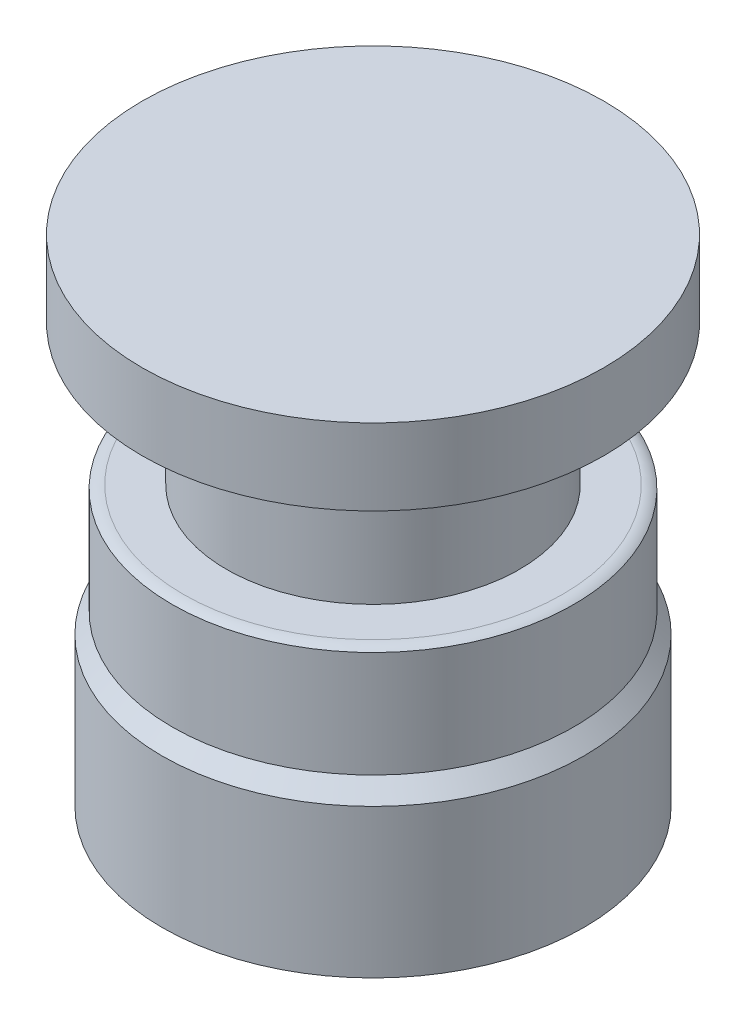
ISO-10303-21;
HEADER;
FILE_DESCRIPTION(('STEP AP214'),'2;1');
FILE_NAME('part.step','',(''),(''),'','','');
FILE_SCHEMA(('AUTOMOTIVE_DESIGN { 1 0 10303 214 1 1 1 1 }'));
ENDSEC;
DATA;
#1=APPLICATION_CONTEXT('core data for automotive mechanical design processes');
#2=APPLICATION_PROTOCOL_DEFINITION('international standard','automotive_design',2000,#1);
#3=PRODUCT_CONTEXT('',#1,'mechanical');
#4=PRODUCT('Part','Part','',(#3));
#5=PRODUCT_RELATED_PRODUCT_CATEGORY('part','',(#4));
#6=PRODUCT_DEFINITION_FORMATION('','',#4);
#7=PRODUCT_DEFINITION_CONTEXT('part definition',#1,'design');
#8=PRODUCT_DEFINITION('design','',#6,#7);
#9=PRODUCT_DEFINITION_SHAPE('','',#8);
#10=(LENGTH_UNIT() NAMED_UNIT(*) SI_UNIT(.MILLI.,.METRE.));
#11=(NAMED_UNIT(*) PLANE_ANGLE_UNIT() SI_UNIT($,.RADIAN.));
#12=(NAMED_UNIT(*) SI_UNIT($,.STERADIAN.) SOLID_ANGLE_UNIT());
#13=UNCERTAINTY_MEASURE_WITH_UNIT(LENGTH_MEASURE(1.E-05),#10,'distance_accuracy_value','');
#14=(GEOMETRIC_REPRESENTATION_CONTEXT(3) GLOBAL_UNCERTAINTY_ASSIGNED_CONTEXT((#13)) GLOBAL_UNIT_ASSIGNED_CONTEXT((#10,
#11,#12)) REPRESENTATION_CONTEXT('',''));
#15=CARTESIAN_POINT('',(0.,0.,0.));
#16=DIRECTION('',(0.,0.,1.));
#17=DIRECTION('',(1.,0.,0.));
#18=AXIS2_PLACEMENT_3D('',#15,#16,#17);
#19=CARTESIAN_POINT('',(-11.5,24.65,0.));
#20=DIRECTION('',(0.,-1.,0.));
#21=DIRECTION('',(0.,0.,-1.));
#22=AXIS2_PLACEMENT_3D('',#19,#20,#21);
#23=PLANE('',#22);
#24=CARTESIAN_POINT('',(0.,24.65,0.));
#25=DIRECTION('',(0.,-1.,0.));
#26=DIRECTION('',(0.,0.,-1.));
#27=AXIS2_PLACEMENT_3D('',#24,#25,#26);
#28=CIRCLE('',#27,11.5);
#29=CARTESIAN_POINT('',(0.,24.65,-11.5));
#30=VERTEX_POINT('',#29);
#31=EDGE_CURVE('E10',#30,#30,#28,.T.);
#32=ORIENTED_EDGE('',*,*,#31,.F.);
#33=EDGE_LOOP('',(#32));
#34=FACE_BOUND('',#33,.T.);
#35=ADVANCED_FACE('F32',(#34),#23,.F.);
#36=CARTESIAN_POINT('',(0.,0.,0.));
#37=DIRECTION('',(0.,-1.,0.));
#38=DIRECTION('',(0.,0.,-1.));
#39=AXIS2_PLACEMENT_3D('',#36,#37,#38);
#40=CYLINDRICAL_SURFACE('',#39,11.5);
#41=CARTESIAN_POINT('',(0.,20.85,0.));
#42=DIRECTION('',(0.,-1.,0.));
#43=DIRECTION('',(0.,0.,-1.));
#44=AXIS2_PLACEMENT_3D('',#41,#42,#43);
#45=CIRCLE('',#44,11.5);
#46=CARTESIAN_POINT('',(0.,20.85,-11.5));
#47=VERTEX_POINT('',#46);
#48=EDGE_CURVE('E38',#47,#47,#45,.T.);
#49=ORIENTED_EDGE('',*,*,#48,.F.);
#50=EDGE_LOOP('',(#49));
#51=FACE_BOUND('',#50,.T.);
#52=ORIENTED_EDGE('',*,*,#31,.T.);
#53=EDGE_LOOP('',(#52));
#54=FACE_BOUND('',#53,.T.);
#55=ADVANCED_FACE('F116',(#51,#54),#40,.T.);
#56=CARTESIAN_POINT('',(-7.3,20.85,0.));
#57=DIRECTION('',(0.,1.,0.));
#58=DIRECTION('',(0.,0.,1.));
#59=AXIS2_PLACEMENT_3D('',#56,#57,#58);
#60=PLANE('',#59);
#61=CARTESIAN_POINT('',(0.,20.85,0.));
#62=DIRECTION('',(0.,-1.,0.));
#63=DIRECTION('',(0.,0.,-1.));
#64=AXIS2_PLACEMENT_3D('',#61,#62,#63);
#65=CIRCLE('',#64,7.3);
#66=CARTESIAN_POINT('',(0.,20.85,-7.3));
#67=VERTEX_POINT('',#66);
#68=EDGE_CURVE('E42',#67,#67,#65,.T.);
#69=ORIENTED_EDGE('',*,*,#68,.F.);
#70=EDGE_LOOP('',(#69));
#71=FACE_BOUND('',#70,.T.);
#72=ORIENTED_EDGE('',*,*,#48,.T.);
#73=EDGE_LOOP('',(#72));
#74=FACE_BOUND('',#73,.T.);
#75=ADVANCED_FACE('F111',(#71,#74),#60,.F.);
#76=CARTESIAN_POINT('',(0.,0.,0.));
#77=DIRECTION('',(0.,-1.,0.));
#78=DIRECTION('',(0.,0.,-1.));
#79=AXIS2_PLACEMENT_3D('',#76,#77,#78);
#80=CYLINDRICAL_SURFACE('',#79,7.3);
#81=CARTESIAN_POINT('',(0.,13.85,0.));
#82=DIRECTION('',(0.,-1.,0.));
#83=DIRECTION('',(0.,0.,-1.));
#84=AXIS2_PLACEMENT_3D('',#81,#82,#83);
#85=CIRCLE('',#84,7.3);
#86=CARTESIAN_POINT('',(0.,13.85,-7.3));
#87=VERTEX_POINT('',#86);
#88=EDGE_CURVE('E46',#87,#87,#85,.T.);
#89=ORIENTED_EDGE('',*,*,#88,.F.);
#90=EDGE_LOOP('',(#89));
#91=FACE_BOUND('',#90,.T.);
#92=ORIENTED_EDGE('',*,*,#68,.T.);
#93=EDGE_LOOP('',(#92));
#94=FACE_BOUND('',#93,.T.);
#95=ADVANCED_FACE('F105',(#91,#94),#80,.T.);
#96=CARTESIAN_POINT('',(-9.45,13.85,0.));
#97=DIRECTION('',(0.,-1.,0.));
#98=DIRECTION('',(0.,0.,-1.));
#99=AXIS2_PLACEMENT_3D('',#96,#97,#98);
#100=PLANE('',#99);
#101=CARTESIAN_POINT('',(0.,13.85,0.));
#102=DIRECTION('',(0.,-1.,0.));
#103=DIRECTION('',(0.,0.,-1.));
#104=AXIS2_PLACEMENT_3D('',#101,#102,#103);
#105=CIRCLE('',#104,9.45);
#106=CARTESIAN_POINT('',(0.,13.85,-9.45));
#107=VERTEX_POINT('',#106);
#108=EDGE_CURVE('E51',#107,#107,#105,.T.);
#109=ORIENTED_EDGE('',*,*,#108,.F.);
#110=EDGE_LOOP('',(#109));
#111=FACE_BOUND('',#110,.T.);
#112=ORIENTED_EDGE('',*,*,#88,.T.);
#113=EDGE_LOOP('',(#112));
#114=FACE_BOUND('',#113,.T.);
#115=ADVANCED_FACE('F99',(#111,#114),#100,.F.);
#116=CARTESIAN_POINT('',(0.,12.85,0.));
#117=DIRECTION('',(0.,-1.,0.));
#118=DIRECTION('',(0.,0.,-1.));
#119=AXIS2_PLACEMENT_3D('',#116,#117,#118);
#120=TOROIDAL_SURFACE('',#119,9.45,1.);
#121=CARTESIAN_POINT('',(0.,13.6851646544245,0.));
#122=DIRECTION('',(0.,-1.,0.));
#123=DIRECTION('',(0.,0.,-1.));
#124=AXIS2_PLACEMENT_3D('',#121,#122,#123);
#125=CIRCLE('',#124,10.);
#126=CARTESIAN_POINT('',(0.,13.6851646544245,-10.));
#127=VERTEX_POINT('',#126);
#128=EDGE_CURVE('E54',#127,#127,#125,.T.);
#129=ORIENTED_EDGE('',*,*,#128,.F.);
#130=EDGE_LOOP('',(#129));
#131=FACE_BOUND('',#130,.T.);
#132=ORIENTED_EDGE('',*,*,#108,.T.);
#133=EDGE_LOOP('',(#132));
#134=FACE_BOUND('',#133,.T.);
#135=ADVANCED_FACE('F93',(#131,#134),#120,.T.);
#136=CARTESIAN_POINT('',(0.,0.,0.));
#137=DIRECTION('',(0.,-1.,0.));
#138=DIRECTION('',(0.,0.,-1.));
#139=AXIS2_PLACEMENT_3D('',#136,#137,#138);
#140=CYLINDRICAL_SURFACE('',#139,10.);
#141=CARTESIAN_POINT('',(0.,8.4,0.));
#142=DIRECTION('',(0.,-1.,0.));
#143=DIRECTION('',(0.,0.,-1.));
#144=AXIS2_PLACEMENT_3D('',#141,#142,#143);
#145=CIRCLE('',#144,10.);
#146=CARTESIAN_POINT('',(0.,8.4,-10.));
#147=VERTEX_POINT('',#146);
#148=EDGE_CURVE('E57',#147,#147,#145,.T.);
#149=ORIENTED_EDGE('',*,*,#148,.F.);
#150=EDGE_LOOP('',(#149));
#151=FACE_BOUND('',#150,.T.);
#152=ORIENTED_EDGE('',*,*,#128,.T.);
#153=EDGE_LOOP('',(#152));
#154=FACE_BOUND('',#153,.T.);
#155=ADVANCED_FACE('F87',(#151,#154),#140,.T.);
#156=CARTESIAN_POINT('',(-9.5,8.4,0.));
#157=DIRECTION('',(0.,1.,0.));
#158=DIRECTION('',(0.,0.,1.));
#159=AXIS2_PLACEMENT_3D('',#156,#157,#158);
#160=PLANE('',#159);
#161=CARTESIAN_POINT('',(0.,8.4,0.));
#162=DIRECTION('',(0.,-1.,0.));
#163=DIRECTION('',(0.,0.,-1.));
#164=AXIS2_PLACEMENT_3D('',#161,#162,#163);
#165=CIRCLE('',#164,9.5);
#166=CARTESIAN_POINT('',(0.,8.4,-9.5));
#167=VERTEX_POINT('',#166);
#168=EDGE_CURVE('E60',#167,#167,#165,.T.);
#169=ORIENTED_EDGE('',*,*,#168,.F.);
#170=EDGE_LOOP('',(#169));
#171=FACE_BOUND('',#170,.T.);
#172=ORIENTED_EDGE('',*,*,#148,.T.);
#173=EDGE_LOOP('',(#172));
#174=FACE_BOUND('',#173,.T.);
#175=ADVANCED_FACE('F81',(#171,#174),#160,.F.);
#176=CARTESIAN_POINT('',(0.,8.4,0.));
#177=DIRECTION('',(0.,-1.,0.));
#178=DIRECTION('',(0.,0.,-1.));
#179=AXIS2_PLACEMENT_3D('',#176,#177,#178);
#180=CONICAL_SURFACE('',#179,9.5,0.785398163397448);
#181=CARTESIAN_POINT('',(0.,7.4,0.));
#182=DIRECTION('',(0.,-1.,0.));
#183=DIRECTION('',(0.,0.,-1.));
#184=AXIS2_PLACEMENT_3D('',#181,#182,#183);
#185=CIRCLE('',#184,10.5);
#186=CARTESIAN_POINT('',(0.,7.4,-10.5));
#187=VERTEX_POINT('',#186);
#188=EDGE_CURVE('E63',#187,#187,#185,.T.);
#189=ORIENTED_EDGE('',*,*,#188,.F.);
#190=EDGE_LOOP('',(#189));
#191=FACE_BOUND('',#190,.T.);
#192=ORIENTED_EDGE('',*,*,#168,.T.);
#193=EDGE_LOOP('',(#192));
#194=FACE_BOUND('',#193,.T.);
#195=ADVANCED_FACE('F75',(#191,#194),#180,.T.);
#196=CARTESIAN_POINT('',(0.,0.,0.));
#197=DIRECTION('',(0.,-1.,0.));
#198=DIRECTION('',(0.,0.,-1.));
#199=AXIS2_PLACEMENT_3D('',#196,#197,#198);
#200=CYLINDRICAL_SURFACE('',#199,10.5);
#201=CARTESIAN_POINT('',(0.,0.,0.));
#202=DIRECTION('',(0.,-1.,0.));
#203=DIRECTION('',(0.,0.,-1.));
#204=AXIS2_PLACEMENT_3D('',#201,#202,#203);
#205=CIRCLE('',#204,10.5);
#206=CARTESIAN_POINT('',(0.,0.,-10.5));
#207=VERTEX_POINT('',#206);
#208=EDGE_CURVE('E66',#207,#207,#205,.T.);
#209=ORIENTED_EDGE('',*,*,#208,.F.);
#210=EDGE_LOOP('',(#209));
#211=FACE_BOUND('',#210,.T.);
#212=ORIENTED_EDGE('',*,*,#188,.T.);
#213=EDGE_LOOP('',(#212));
#214=FACE_BOUND('',#213,.T.);
#215=ADVANCED_FACE('F72',(#211,#214),#200,.T.);
#216=CARTESIAN_POINT('',(0.,0.,0.));
#217=DIRECTION('',(0.,1.,0.));
#218=DIRECTION('',(0.,0.,1.));
#219=AXIS2_PLACEMENT_3D('',#216,#217,#218);
#220=PLANE('',#219);
#221=ORIENTED_EDGE('',*,*,#208,.T.);
#222=EDGE_LOOP('',(#221));
#223=FACE_BOUND('',#222,.T.);
#224=ADVANCED_FACE('F70',(#223),#220,.F.);
#225=CLOSED_SHELL('',(#35,#55,#75,#95,#115,#135,#155,#175,#195,#215,#224));
#226=MANIFOLD_SOLID_BREP('B2',#225);
#227=ADVANCED_BREP_SHAPE_REPRESENTATION('',(#18,#226),#14);
#228=SHAPE_DEFINITION_REPRESENTATION(#9,#227);
ENDSEC;
END-ISO-10303-21;
